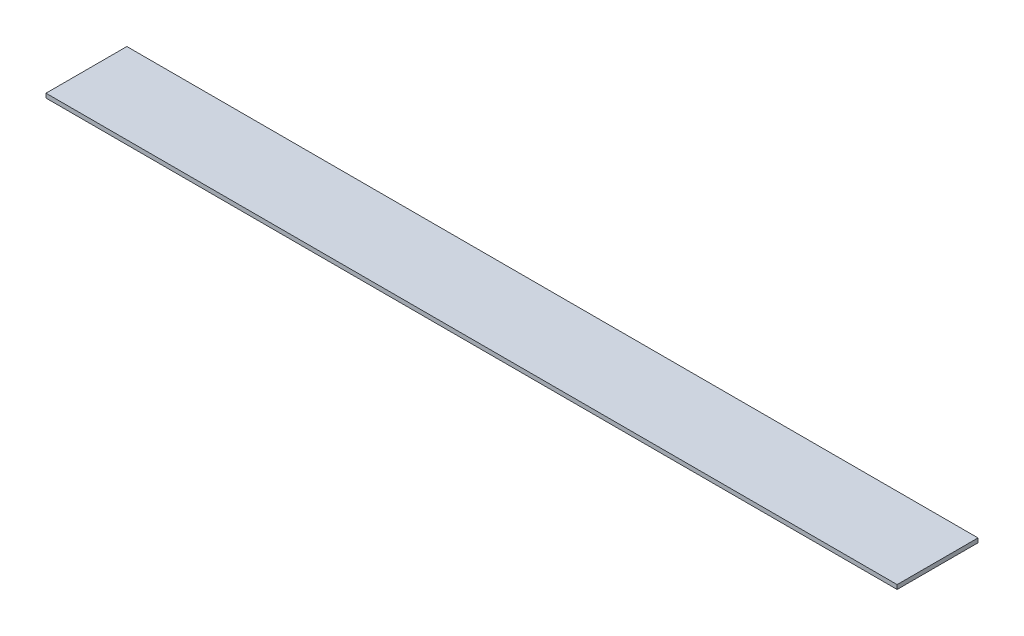
ISO-10303-21;
HEADER;
FILE_DESCRIPTION(('STEP AP214'),'2;1');
FILE_NAME('part.step','',(''),(''),'','','');
FILE_SCHEMA(('AUTOMOTIVE_DESIGN { 1 0 10303 214 1 1 1 1 }'));
ENDSEC;
DATA;
#1=APPLICATION_CONTEXT('core data for automotive mechanical design processes');
#2=APPLICATION_PROTOCOL_DEFINITION('international standard','automotive_design',2000,#1);
#3=PRODUCT_CONTEXT('',#1,'mechanical');
#4=PRODUCT('Part','Part','',(#3));
#5=PRODUCT_RELATED_PRODUCT_CATEGORY('part','',(#4));
#6=PRODUCT_DEFINITION_FORMATION('','',#4);
#7=PRODUCT_DEFINITION_CONTEXT('part definition',#1,'design');
#8=PRODUCT_DEFINITION('design','',#6,#7);
#9=PRODUCT_DEFINITION_SHAPE('','',#8);
#10=(LENGTH_UNIT() NAMED_UNIT(*) SI_UNIT(.MILLI.,.METRE.));
#11=(NAMED_UNIT(*) PLANE_ANGLE_UNIT() SI_UNIT($,.RADIAN.));
#12=(NAMED_UNIT(*) SI_UNIT($,.STERADIAN.) SOLID_ANGLE_UNIT());
#13=UNCERTAINTY_MEASURE_WITH_UNIT(LENGTH_MEASURE(1.E-05),#10,'distance_accuracy_value','');
#14=(GEOMETRIC_REPRESENTATION_CONTEXT(3) GLOBAL_UNCERTAINTY_ASSIGNED_CONTEXT((#13)) GLOBAL_UNIT_ASSIGNED_CONTEXT((#10,
#11,#12)) REPRESENTATION_CONTEXT('',''));
#15=CARTESIAN_POINT('',(0.,0.,0.));
#16=DIRECTION('',(0.,0.,1.));
#17=DIRECTION('',(1.,0.,0.));
#18=AXIS2_PLACEMENT_3D('',#15,#16,#17);
#19=CARTESIAN_POINT('',(0.,0.,3.));
#20=DIRECTION('',(0.,0.,1.));
#21=DIRECTION('',(1.,0.,0.));
#22=AXIS2_PLACEMENT_3D('',#19,#20,#21);
#23=PLANE('',#22);
#24=DIRECTION('',(0.,1.,0.));
#25=VECTOR('',#24,1.);
#26=CARTESIAN_POINT('',(-300.,0.,3.));
#27=LINE('',#26,#25);
#28=CARTESIAN_POINT('',(-300.,-50.,3.));
#29=VERTEX_POINT('',#28);
#30=CARTESIAN_POINT('',(-300.,-47.,3.));
#31=VERTEX_POINT('',#30);
#32=EDGE_CURVE('E11',#29,#31,#27,.T.);
#33=ORIENTED_EDGE('',*,*,#32,.T.);
#34=DIRECTION('',(-1.,0.,0.));
#35=VECTOR('',#34,1.);
#36=CARTESIAN_POINT('',(-300.,-47.,3.));
#37=LINE('',#36,#35);
#38=CARTESIAN_POINT('',(300.,-47.,3.));
#39=VERTEX_POINT('',#38);
#40=EDGE_CURVE('E99',#39,#31,#37,.T.);
#41=ORIENTED_EDGE('',*,*,#40,.F.);
#42=DIRECTION('',(0.,1.,0.));
#43=VECTOR('',#42,1.);
#44=CARTESIAN_POINT('',(300.,1.71683972880179E-13,3.));
#45=LINE('',#44,#43);
#46=CARTESIAN_POINT('',(300.,-50.,3.));
#47=VERTEX_POINT('',#46);
#48=EDGE_CURVE('E40',#47,#39,#45,.T.);
#49=ORIENTED_EDGE('',*,*,#48,.F.);
#50=DIRECTION('',(1.,0.,0.));
#51=VECTOR('',#50,1.);
#52=CARTESIAN_POINT('',(-300.,-50.,3.));
#53=LINE('',#52,#51);
#54=EDGE_CURVE('E35',#29,#47,#53,.T.);
#55=ORIENTED_EDGE('',*,*,#54,.F.);
#56=EDGE_LOOP('',(#33,#41,#49,#55));
#57=FACE_BOUND('',#56,.T.);
#58=ADVANCED_FACE('F32',(#57),#23,.F.);
#59=CARTESIAN_POINT('',(-300.,0.,60.));
#60=DIRECTION('',(0.,0.,1.));
#61=DIRECTION('',(1.,0.,0.));
#62=AXIS2_PLACEMENT_3D('',#59,#60,#61);
#63=PLANE('',#62);
#64=DIRECTION('',(1.,0.,0.));
#65=VECTOR('',#64,1.);
#66=CARTESIAN_POINT('',(-300.,-47.,60.));
#67=LINE('',#66,#65);
#68=CARTESIAN_POINT('',(-300.,-47.,60.));
#69=VERTEX_POINT('',#68);
#70=CARTESIAN_POINT('',(300.,-47.,60.));
#71=VERTEX_POINT('',#70);
#72=EDGE_CURVE('E84',#69,#71,#67,.T.);
#73=ORIENTED_EDGE('',*,*,#72,.F.);
#74=DIRECTION('',(0.,-1.,0.));
#75=VECTOR('',#74,1.);
#76=CARTESIAN_POINT('',(-300.,0.,60.));
#77=LINE('',#76,#75);
#78=CARTESIAN_POINT('',(-300.,-50.,60.));
#79=VERTEX_POINT('',#78);
#80=EDGE_CURVE('E74',#69,#79,#77,.T.);
#81=ORIENTED_EDGE('',*,*,#80,.T.);
#82=DIRECTION('',(1.,0.,0.));
#83=VECTOR('',#82,1.);
#84=CARTESIAN_POINT('',(-300.,-50.,60.));
#85=LINE('',#84,#83);
#86=CARTESIAN_POINT('',(300.,-50.,60.));
#87=VERTEX_POINT('',#86);
#88=EDGE_CURVE('E77',#79,#87,#85,.T.);
#89=ORIENTED_EDGE('',*,*,#88,.T.);
#90=DIRECTION('',(0.,-1.,0.));
#91=VECTOR('',#90,1.);
#92=CARTESIAN_POINT('',(300.,3.43367945760358E-13,60.));
#93=LINE('',#92,#91);
#94=EDGE_CURVE('E85',#71,#87,#93,.T.);
#95=ORIENTED_EDGE('',*,*,#94,.F.);
#96=EDGE_LOOP('',(#73,#81,#89,#95));
#97=FACE_BOUND('',#96,.T.);
#98=ADVANCED_FACE('F81',(#97),#63,.T.);
#99=CARTESIAN_POINT('',(-300.,0.,0.));
#100=DIRECTION('',(-1.,0.,0.));
#101=DIRECTION('',(0.,0.,1.));
#102=AXIS2_PLACEMENT_3D('',#99,#100,#101);
#103=PLANE('',#102);
#104=ORIENTED_EDGE('',*,*,#32,.F.);
#105=DIRECTION('',(0.,0.,-1.));
#106=VECTOR('',#105,1.);
#107=CARTESIAN_POINT('',(-300.,-50.,60.));
#108=LINE('',#107,#106);
#109=EDGE_CURVE('E70',#79,#29,#108,.T.);
#110=ORIENTED_EDGE('',*,*,#109,.F.);
#111=ORIENTED_EDGE('',*,*,#80,.F.);
#112=DIRECTION('',(0.,0.,1.));
#113=VECTOR('',#112,1.);
#114=CARTESIAN_POINT('',(-300.,-47.,3.));
#115=LINE('',#114,#113);
#116=EDGE_CURVE('E91',#31,#69,#115,.T.);
#117=ORIENTED_EDGE('',*,*,#116,.F.);
#118=EDGE_LOOP('',(#104,#110,#111,#117));
#119=FACE_BOUND('',#118,.T.);
#120=ADVANCED_FACE('F72',(#119),#103,.T.);
#121=CARTESIAN_POINT('',(300.,1.71683972880179E-13,0.));
#122=DIRECTION('',(-1.,0.,0.));
#123=DIRECTION('',(0.,-1.,0.));
#124=AXIS2_PLACEMENT_3D('',#121,#122,#123);
#125=PLANE('',#124);
#126=DIRECTION('',(0.,0.,-1.));
#127=VECTOR('',#126,1.);
#128=CARTESIAN_POINT('',(300.,-50.,60.));
#129=LINE('',#128,#127);
#130=EDGE_CURVE('E89',#87,#47,#129,.T.);
#131=ORIENTED_EDGE('',*,*,#130,.T.);
#132=ORIENTED_EDGE('',*,*,#48,.T.);
#133=DIRECTION('',(0.,0.,1.));
#134=VECTOR('',#133,1.);
#135=CARTESIAN_POINT('',(300.,-47.,3.));
#136=LINE('',#135,#134);
#137=EDGE_CURVE('E96',#39,#71,#136,.T.);
#138=ORIENTED_EDGE('',*,*,#137,.T.);
#139=ORIENTED_EDGE('',*,*,#94,.T.);
#140=EDGE_LOOP('',(#131,#132,#138,#139));
#141=FACE_BOUND('',#140,.T.);
#142=ADVANCED_FACE('F102',(#141),#125,.F.);
#143=CARTESIAN_POINT('',(-300.,-47.,3.));
#144=DIRECTION('',(0.,-1.,0.));
#145=DIRECTION('',(0.,0.,-1.));
#146=AXIS2_PLACEMENT_3D('',#143,#144,#145);
#147=PLANE('',#146);
#148=ORIENTED_EDGE('',*,*,#137,.F.);
#149=ORIENTED_EDGE('',*,*,#40,.T.);
#150=ORIENTED_EDGE('',*,*,#116,.T.);
#151=ORIENTED_EDGE('',*,*,#72,.T.);
#152=EDGE_LOOP('',(#148,#149,#150,#151));
#153=FACE_BOUND('',#152,.T.);
#154=ADVANCED_FACE('F105',(#153),#147,.F.);
#155=CARTESIAN_POINT('',(-300.,-50.,60.));
#156=DIRECTION('',(0.,1.,0.));
#157=DIRECTION('',(0.,0.,1.));
#158=AXIS2_PLACEMENT_3D('',#155,#156,#157);
#159=PLANE('',#158);
#160=ORIENTED_EDGE('',*,*,#109,.T.);
#161=ORIENTED_EDGE('',*,*,#54,.T.);
#162=ORIENTED_EDGE('',*,*,#130,.F.);
#163=ORIENTED_EDGE('',*,*,#88,.F.);
#164=EDGE_LOOP('',(#160,#161,#162,#163));
#165=FACE_BOUND('',#164,.T.);
#166=ADVANCED_FACE('F87',(#165),#159,.F.);
#167=CLOSED_SHELL('',(#58,#98,#120,#142,#154,#166));
#168=MANIFOLD_SOLID_BREP('B2',#167);
#169=ADVANCED_BREP_SHAPE_REPRESENTATION('',(#18,#168),#14);
#170=SHAPE_DEFINITION_REPRESENTATION(#9,#169);
ENDSEC;
END-ISO-10303-21;
